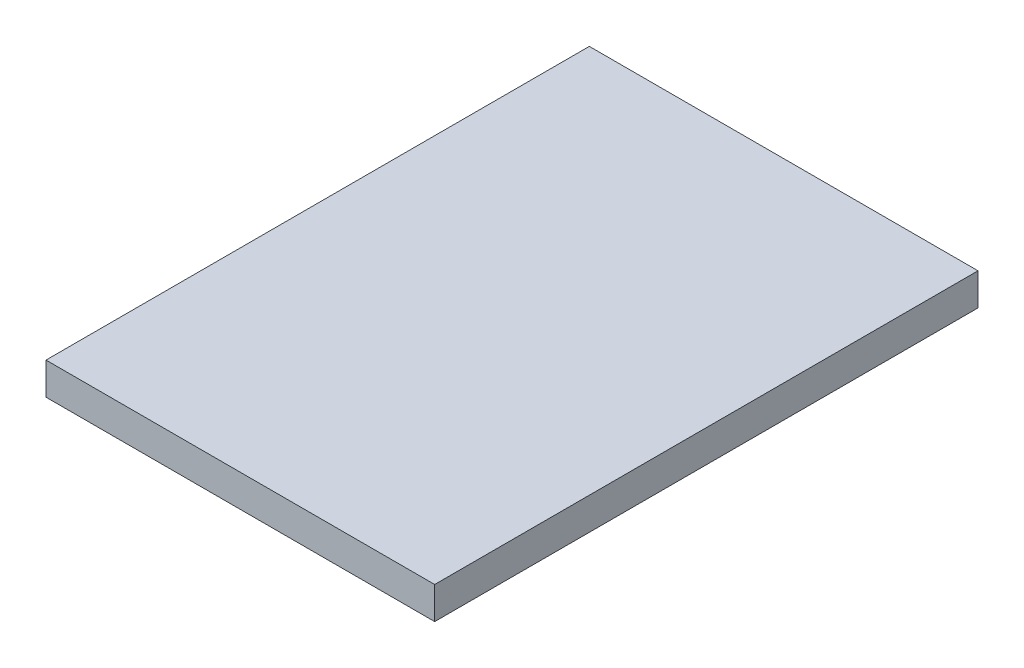
ISO-10303-21;
HEADER;
FILE_DESCRIPTION(('STEP AP214'),'2;1');
FILE_NAME('part.step','',(''),(''),'','','');
FILE_SCHEMA(('AUTOMOTIVE_DESIGN { 1 0 10303 214 1 1 1 1 }'));
ENDSEC;
DATA;
#1=APPLICATION_CONTEXT('core data for automotive mechanical design processes');
#2=APPLICATION_PROTOCOL_DEFINITION('international standard','automotive_design',2000,#1);
#3=PRODUCT_CONTEXT('',#1,'mechanical');
#4=PRODUCT('Part','Part','',(#3));
#5=PRODUCT_RELATED_PRODUCT_CATEGORY('part','',(#4));
#6=PRODUCT_DEFINITION_FORMATION('','',#4);
#7=PRODUCT_DEFINITION_CONTEXT('part definition',#1,'design');
#8=PRODUCT_DEFINITION('design','',#6,#7);
#9=PRODUCT_DEFINITION_SHAPE('','',#8);
#10=(LENGTH_UNIT() NAMED_UNIT(*) SI_UNIT(.MILLI.,.METRE.));
#11=(NAMED_UNIT(*) PLANE_ANGLE_UNIT() SI_UNIT($,.RADIAN.));
#12=(NAMED_UNIT(*) SI_UNIT($,.STERADIAN.) SOLID_ANGLE_UNIT());
#13=UNCERTAINTY_MEASURE_WITH_UNIT(LENGTH_MEASURE(1.E-05),#10,'distance_accuracy_value','');
#14=(GEOMETRIC_REPRESENTATION_CONTEXT(3) GLOBAL_UNCERTAINTY_ASSIGNED_CONTEXT((#13)) GLOBAL_UNIT_ASSIGNED_CONTEXT((#10,
#11,#12)) REPRESENTATION_CONTEXT('',''));
#15=CARTESIAN_POINT('',(0.,0.,0.));
#16=DIRECTION('',(0.,0.,1.));
#17=DIRECTION('',(1.,0.,0.));
#18=AXIS2_PLACEMENT_3D('',#15,#16,#17);
#19=CARTESIAN_POINT('',(9.3,1.54,13.));
#20=DIRECTION('',(-1.,0.,0.));
#21=DIRECTION('',(0.,0.,1.));
#22=AXIS2_PLACEMENT_3D('',#19,#20,#21);
#23=PLANE('',#22);
#24=DIRECTION('',(0.,0.,-1.));
#25=VECTOR('',#24,1.);
#26=CARTESIAN_POINT('',(9.3,0.,13.));
#27=LINE('',#26,#25);
#28=CARTESIAN_POINT('',(9.3,0.,13.));
#29=VERTEX_POINT('',#28);
#30=CARTESIAN_POINT('',(9.3,0.,-13.));
#31=VERTEX_POINT('',#30);
#32=EDGE_CURVE('E97',#29,#31,#27,.T.);
#33=ORIENTED_EDGE('',*,*,#32,.T.);
#34=DIRECTION('',(0.,-1.,0.));
#35=VECTOR('',#34,1.);
#36=CARTESIAN_POINT('',(9.3,1.54,-13.));
#37=LINE('',#36,#35);
#38=CARTESIAN_POINT('',(9.3,1.54,-13.));
#39=VERTEX_POINT('',#38);
#40=EDGE_CURVE('E11',#39,#31,#37,.T.);
#41=ORIENTED_EDGE('',*,*,#40,.F.);
#42=DIRECTION('',(0.,0.,-1.));
#43=VECTOR('',#42,1.);
#44=CARTESIAN_POINT('',(9.3,1.54,13.));
#45=LINE('',#44,#43);
#46=CARTESIAN_POINT('',(9.3,1.54,13.));
#47=VERTEX_POINT('',#46);
#48=EDGE_CURVE('E85',#47,#39,#45,.T.);
#49=ORIENTED_EDGE('',*,*,#48,.F.);
#50=DIRECTION('',(0.,-1.,0.));
#51=VECTOR('',#50,1.);
#52=CARTESIAN_POINT('',(9.3,1.54,13.));
#53=LINE('',#52,#51);
#54=EDGE_CURVE('E93',#47,#29,#53,.T.);
#55=ORIENTED_EDGE('',*,*,#54,.T.);
#56=EDGE_LOOP('',(#33,#41,#49,#55));
#57=FACE_BOUND('',#56,.T.);
#58=ADVANCED_FACE('F34',(#57),#23,.F.);
#59=CARTESIAN_POINT('',(-9.3,1.54,-13.));
#60=DIRECTION('',(0.,0.,1.));
#61=DIRECTION('',(1.,0.,0.));
#62=AXIS2_PLACEMENT_3D('',#59,#60,#61);
#63=PLANE('',#62);
#64=DIRECTION('',(-1.,0.,0.));
#65=VECTOR('',#64,1.);
#66=CARTESIAN_POINT('',(-9.3,0.,-13.));
#67=LINE('',#66,#65);
#68=CARTESIAN_POINT('',(-9.3,0.,-13.));
#69=VERTEX_POINT('',#68);
#70=EDGE_CURVE('E89',#31,#69,#67,.T.);
#71=ORIENTED_EDGE('',*,*,#70,.T.);
#72=DIRECTION('',(0.,-1.,0.));
#73=VECTOR('',#72,1.);
#74=CARTESIAN_POINT('',(-9.3,1.54,-13.));
#75=LINE('',#74,#73);
#76=CARTESIAN_POINT('',(-9.3,1.54,-13.));
#77=VERTEX_POINT('',#76);
#78=EDGE_CURVE('E42',#77,#69,#75,.T.);
#79=ORIENTED_EDGE('',*,*,#78,.F.);
#80=DIRECTION('',(-1.,0.,0.));
#81=VECTOR('',#80,1.);
#82=CARTESIAN_POINT('',(-9.3,1.54,-13.));
#83=LINE('',#82,#81);
#84=EDGE_CURVE('E80',#39,#77,#83,.T.);
#85=ORIENTED_EDGE('',*,*,#84,.F.);
#86=ORIENTED_EDGE('',*,*,#40,.T.);
#87=EDGE_LOOP('',(#71,#79,#85,#86));
#88=FACE_BOUND('',#87,.T.);
#89=ADVANCED_FACE('F88',(#88),#63,.F.);
#90=CARTESIAN_POINT('',(-9.3,1.54,13.));
#91=DIRECTION('',(1.,0.,0.));
#92=DIRECTION('',(0.,0.,-1.));
#93=AXIS2_PLACEMENT_3D('',#90,#91,#92);
#94=PLANE('',#93);
#95=DIRECTION('',(0.,0.,1.));
#96=VECTOR('',#95,1.);
#97=CARTESIAN_POINT('',(-9.3,0.,13.));
#98=LINE('',#97,#96);
#99=CARTESIAN_POINT('',(-9.3,0.,13.));
#100=VERTEX_POINT('',#99);
#101=EDGE_CURVE('E67',#69,#100,#98,.T.);
#102=ORIENTED_EDGE('',*,*,#101,.T.);
#103=DIRECTION('',(0.,-1.,0.));
#104=VECTOR('',#103,1.);
#105=CARTESIAN_POINT('',(-9.3,1.54,13.));
#106=LINE('',#105,#104);
#107=CARTESIAN_POINT('',(-9.3,1.54,13.));
#108=VERTEX_POINT('',#107);
#109=EDGE_CURVE('E90',#108,#100,#106,.T.);
#110=ORIENTED_EDGE('',*,*,#109,.F.);
#111=DIRECTION('',(0.,0.,1.));
#112=VECTOR('',#111,1.);
#113=CARTESIAN_POINT('',(-9.3,1.54,13.));
#114=LINE('',#113,#112);
#115=EDGE_CURVE('E83',#77,#108,#114,.T.);
#116=ORIENTED_EDGE('',*,*,#115,.F.);
#117=ORIENTED_EDGE('',*,*,#78,.T.);
#118=EDGE_LOOP('',(#102,#110,#116,#117));
#119=FACE_BOUND('',#118,.T.);
#120=ADVANCED_FACE('F91',(#119),#94,.F.);
#121=CARTESIAN_POINT('',(-9.3,1.54,13.));
#122=DIRECTION('',(0.,0.,-1.));
#123=DIRECTION('',(-1.,0.,0.));
#124=AXIS2_PLACEMENT_3D('',#121,#122,#123);
#125=PLANE('',#124);
#126=DIRECTION('',(1.,0.,0.));
#127=VECTOR('',#126,1.);
#128=CARTESIAN_POINT('',(-9.3,0.,13.));
#129=LINE('',#128,#127);
#130=EDGE_CURVE('E73',#100,#29,#129,.T.);
#131=ORIENTED_EDGE('',*,*,#130,.T.);
#132=ORIENTED_EDGE('',*,*,#54,.F.);
#133=DIRECTION('',(1.,0.,0.));
#134=VECTOR('',#133,1.);
#135=CARTESIAN_POINT('',(-9.3,1.54,13.));
#136=LINE('',#135,#134);
#137=EDGE_CURVE('E50',#108,#47,#136,.T.);
#138=ORIENTED_EDGE('',*,*,#137,.F.);
#139=ORIENTED_EDGE('',*,*,#109,.T.);
#140=EDGE_LOOP('',(#131,#132,#138,#139));
#141=FACE_BOUND('',#140,.T.);
#142=ADVANCED_FACE('F104',(#141),#125,.F.);
#143=CARTESIAN_POINT('',(0.,1.54,0.));
#144=DIRECTION('',(0.,-1.,0.));
#145=DIRECTION('',(0.,0.,-1.));
#146=AXIS2_PLACEMENT_3D('',#143,#144,#145);
#147=PLANE('',#146);
#148=ORIENTED_EDGE('',*,*,#48,.T.);
#149=ORIENTED_EDGE('',*,*,#84,.T.);
#150=ORIENTED_EDGE('',*,*,#115,.T.);
#151=ORIENTED_EDGE('',*,*,#137,.T.);
#152=EDGE_LOOP('',(#148,#149,#150,#151));
#153=FACE_BOUND('',#152,.T.);
#154=ADVANCED_FACE('F81',(#153),#147,.F.);
#155=CARTESIAN_POINT('',(0.,0.,0.));
#156=DIRECTION('',(0.,-1.,0.));
#157=DIRECTION('',(0.,0.,-1.));
#158=AXIS2_PLACEMENT_3D('',#155,#156,#157);
#159=PLANE('',#158);
#160=ORIENTED_EDGE('',*,*,#32,.F.);
#161=ORIENTED_EDGE('',*,*,#130,.F.);
#162=ORIENTED_EDGE('',*,*,#101,.F.);
#163=ORIENTED_EDGE('',*,*,#70,.F.);
#164=EDGE_LOOP('',(#160,#161,#162,#163));
#165=FACE_BOUND('',#164,.T.);
#166=ADVANCED_FACE('F107',(#165),#159,.T.);
#167=CLOSED_SHELL('',(#58,#89,#120,#142,#154,#166));
#168=MANIFOLD_SOLID_BREP('B2',#167);
#169=ADVANCED_BREP_SHAPE_REPRESENTATION('',(#18,#168),#14);
#170=SHAPE_DEFINITION_REPRESENTATION(#9,#169);
ENDSEC;
END-ISO-10303-21;
